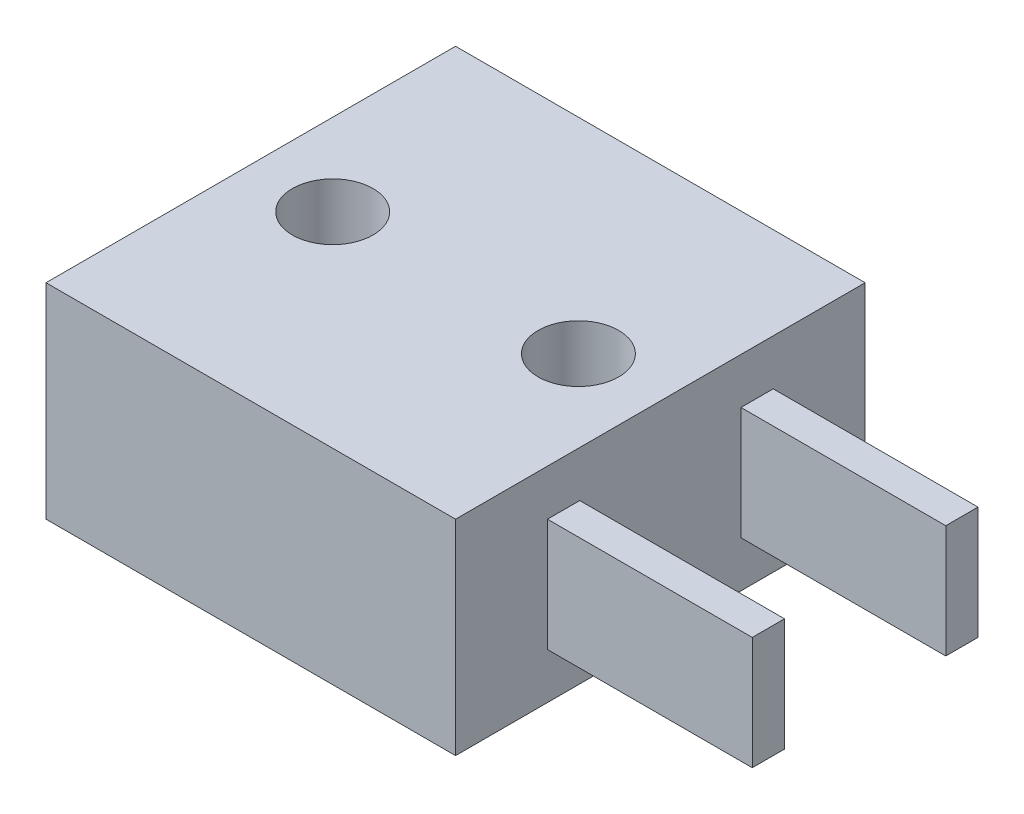
ISO-10303-21;
HEADER;
FILE_DESCRIPTION(('STEP AP214'),'2;1');
FILE_NAME('part.step','',(''),(''),'','','');
FILE_SCHEMA(('AUTOMOTIVE_DESIGN { 1 0 10303 214 1 1 1 1 }'));
ENDSEC;
DATA;
#1=APPLICATION_CONTEXT('core data for automotive mechanical design processes');
#2=APPLICATION_PROTOCOL_DEFINITION('international standard','automotive_design',2000,#1);
#3=PRODUCT_CONTEXT('',#1,'mechanical');
#4=PRODUCT('Part','Part','',(#3));
#5=PRODUCT_RELATED_PRODUCT_CATEGORY('part','',(#4));
#6=PRODUCT_DEFINITION_FORMATION('','',#4);
#7=PRODUCT_DEFINITION_CONTEXT('part definition',#1,'design');
#8=PRODUCT_DEFINITION('design','',#6,#7);
#9=PRODUCT_DEFINITION_SHAPE('','',#8);
#10=(LENGTH_UNIT() NAMED_UNIT(*) SI_UNIT(.MILLI.,.METRE.));
#11=(NAMED_UNIT(*) PLANE_ANGLE_UNIT() SI_UNIT($,.RADIAN.));
#12=(NAMED_UNIT(*) SI_UNIT($,.STERADIAN.) SOLID_ANGLE_UNIT());
#13=UNCERTAINTY_MEASURE_WITH_UNIT(LENGTH_MEASURE(1.E-05),#10,'distance_accuracy_value','');
#14=(GEOMETRIC_REPRESENTATION_CONTEXT(3) GLOBAL_UNCERTAINTY_ASSIGNED_CONTEXT((#13)) GLOBAL_UNIT_ASSIGNED_CONTEXT((#10,
#11,#12)) REPRESENTATION_CONTEXT('',''));
#15=CARTESIAN_POINT('',(0.,0.,0.));
#16=DIRECTION('',(0.,0.,1.));
#17=DIRECTION('',(1.,0.,0.));
#18=AXIS2_PLACEMENT_3D('',#15,#16,#17);
#19=CARTESIAN_POINT('',(0.,3.175,0.));
#20=DIRECTION('',(0.,1.,0.));
#21=DIRECTION('',(0.,0.,1.));
#22=AXIS2_PLACEMENT_3D('',#19,#20,#21);
#23=PLANE('',#22);
#24=CARTESIAN_POINT('',(-3.81,3.175,0.));
#25=DIRECTION('',(0.,1.,0.));
#26=DIRECTION('',(0.,0.,1.));
#27=AXIS2_PLACEMENT_3D('',#24,#25,#26);
#28=CIRCLE('',#27,1.25);
#29=CARTESIAN_POINT('',(-3.81,3.175,1.25));
#30=VERTEX_POINT('',#29);
#31=EDGE_CURVE('E227',#30,#30,#28,.T.);
#32=ORIENTED_EDGE('',*,*,#31,.F.);
#33=EDGE_LOOP('',(#32));
#34=FACE_BOUND('',#33,.T.);
#35=DIRECTION('',(0.,0.,-1.));
#36=VECTOR('',#35,1.);
#37=CARTESIAN_POINT('',(6.35,3.175,-6.35));
#38=LINE('',#37,#36);
#39=CARTESIAN_POINT('',(6.35,3.175,6.35));
#40=VERTEX_POINT('',#39);
#41=CARTESIAN_POINT('',(6.35,3.175,-6.35));
#42=VERTEX_POINT('',#41);
#43=EDGE_CURVE('E235',#40,#42,#38,.T.);
#44=ORIENTED_EDGE('',*,*,#43,.T.);
#45=DIRECTION('',(-1.,0.,0.));
#46=VECTOR('',#45,1.);
#47=CARTESIAN_POINT('',(-6.35,3.175,-6.35));
#48=LINE('',#47,#46);
#49=CARTESIAN_POINT('',(-6.35,3.175,-6.35));
#50=VERTEX_POINT('',#49);
#51=EDGE_CURVE('E239',#42,#50,#48,.T.);
#52=ORIENTED_EDGE('',*,*,#51,.T.);
#53=DIRECTION('',(0.,0.,1.));
#54=VECTOR('',#53,1.);
#55=CARTESIAN_POINT('',(-6.35,3.175,-6.35));
#56=LINE('',#55,#54);
#57=CARTESIAN_POINT('',(-6.35,3.175,6.35));
#58=VERTEX_POINT('',#57);
#59=EDGE_CURVE('E243',#50,#58,#56,.T.);
#60=ORIENTED_EDGE('',*,*,#59,.T.);
#61=DIRECTION('',(1.,0.,0.));
#62=VECTOR('',#61,1.);
#63=CARTESIAN_POINT('',(-6.35,3.175,6.35));
#64=LINE('',#63,#62);
#65=EDGE_CURVE('E246',#58,#40,#64,.T.);
#66=ORIENTED_EDGE('',*,*,#65,.T.);
#67=EDGE_LOOP('',(#44,#52,#60,#66));
#68=FACE_BOUND('',#67,.T.);
#69=CARTESIAN_POINT('',(3.81,3.175,0.));
#70=DIRECTION('',(0.,1.,0.));
#71=DIRECTION('',(0.,0.,1.));
#72=AXIS2_PLACEMENT_3D('',#69,#70,#71);
#73=CIRCLE('',#72,1.25);
#74=CARTESIAN_POINT('',(3.81,3.175,1.25));
#75=VERTEX_POINT('',#74);
#76=EDGE_CURVE('E219',#75,#75,#73,.T.);
#77=ORIENTED_EDGE('',*,*,#76,.F.);
#78=EDGE_LOOP('',(#77));
#79=FACE_BOUND('',#78,.T.);
#80=ADVANCED_FACE('F47',(#34,#68,#79),#23,.T.);
#81=CARTESIAN_POINT('',(0.,-3.175,0.));
#82=DIRECTION('',(0.,1.,0.));
#83=DIRECTION('',(0.,0.,1.));
#84=AXIS2_PLACEMENT_3D('',#81,#82,#83);
#85=PLANE('',#84);
#86=DIRECTION('',(0.,0.,-1.));
#87=VECTOR('',#86,1.);
#88=CARTESIAN_POINT('',(6.35,-3.175,-6.35));
#89=LINE('',#88,#87);
#90=CARTESIAN_POINT('',(6.35,-3.175,6.35));
#91=VERTEX_POINT('',#90);
#92=CARTESIAN_POINT('',(6.35,-3.175,-6.35));
#93=VERTEX_POINT('',#92);
#94=EDGE_CURVE('E231',#91,#93,#89,.T.);
#95=ORIENTED_EDGE('',*,*,#94,.F.);
#96=DIRECTION('',(1.,0.,0.));
#97=VECTOR('',#96,1.);
#98=CARTESIAN_POINT('',(-6.35,-3.175,6.35));
#99=LINE('',#98,#97);
#100=CARTESIAN_POINT('',(-6.35,-3.175,6.35));
#101=VERTEX_POINT('',#100);
#102=EDGE_CURVE('E240',#101,#91,#99,.T.);
#103=ORIENTED_EDGE('',*,*,#102,.F.);
#104=DIRECTION('',(0.,0.,1.));
#105=VECTOR('',#104,1.);
#106=CARTESIAN_POINT('',(-6.35,-3.175,-6.35));
#107=LINE('',#106,#105);
#108=CARTESIAN_POINT('',(-6.35,-3.175,-6.35));
#109=VERTEX_POINT('',#108);
#110=EDGE_CURVE('E256',#109,#101,#107,.T.);
#111=ORIENTED_EDGE('',*,*,#110,.F.);
#112=DIRECTION('',(-1.,0.,0.));
#113=VECTOR('',#112,1.);
#114=CARTESIAN_POINT('',(-6.35,-3.175,-6.35));
#115=LINE('',#114,#113);
#116=EDGE_CURVE('E253',#93,#109,#115,.T.);
#117=ORIENTED_EDGE('',*,*,#116,.F.);
#118=EDGE_LOOP('',(#95,#103,#111,#117));
#119=FACE_BOUND('',#118,.T.);
#120=CARTESIAN_POINT('',(-3.81,-3.175,0.));
#121=DIRECTION('',(0.,1.,0.));
#122=DIRECTION('',(0.,0.,1.));
#123=AXIS2_PLACEMENT_3D('',#120,#121,#122);
#124=CIRCLE('',#123,1.25);
#125=CARTESIAN_POINT('',(-3.81,-3.175,1.25));
#126=VERTEX_POINT('',#125);
#127=EDGE_CURVE('E223',#126,#126,#124,.T.);
#128=ORIENTED_EDGE('',*,*,#127,.T.);
#129=EDGE_LOOP('',(#128));
#130=FACE_BOUND('',#129,.T.);
#131=CARTESIAN_POINT('',(3.81,-3.175,0.));
#132=DIRECTION('',(0.,1.,0.));
#133=DIRECTION('',(0.,0.,1.));
#134=AXIS2_PLACEMENT_3D('',#131,#132,#133);
#135=CIRCLE('',#134,1.25);
#136=CARTESIAN_POINT('',(3.81,-3.175,1.25));
#137=VERTEX_POINT('',#136);
#138=EDGE_CURVE('E218',#137,#137,#135,.T.);
#139=ORIENTED_EDGE('',*,*,#138,.T.);
#140=EDGE_LOOP('',(#139));
#141=FACE_BOUND('',#140,.T.);
#142=ADVANCED_FACE('F279',(#119,#130,#141),#85,.F.);
#143=CARTESIAN_POINT('',(6.35,3.175,-6.35));
#144=DIRECTION('',(-1.,0.,0.));
#145=DIRECTION('',(0.,0.,1.));
#146=AXIS2_PLACEMENT_3D('',#143,#144,#145);
#147=PLANE('',#146);
#148=DIRECTION('',(0.,-1.,0.));
#149=VECTOR('',#148,1.);
#150=CARTESIAN_POINT('',(6.35,1.75,3.5));
#151=LINE('',#150,#149);
#152=CARTESIAN_POINT('',(6.35,1.75,3.5));
#153=VERTEX_POINT('',#152);
#154=CARTESIAN_POINT('',(6.35,-1.75,3.5));
#155=VERTEX_POINT('',#154);
#156=EDGE_CURVE('E63',#153,#155,#151,.T.);
#157=ORIENTED_EDGE('',*,*,#156,.F.);
#158=DIRECTION('',(0.,0.,1.));
#159=VECTOR('',#158,1.);
#160=CARTESIAN_POINT('',(6.35,1.75,3.5));
#161=LINE('',#160,#159);
#162=CARTESIAN_POINT('',(6.35,1.75,2.5));
#163=VERTEX_POINT('',#162);
#164=EDGE_CURVE('E67',#163,#153,#161,.T.);
#165=ORIENTED_EDGE('',*,*,#164,.F.);
#166=DIRECTION('',(0.,-1.,0.));
#167=VECTOR('',#166,1.);
#168=CARTESIAN_POINT('',(6.35,1.75,2.5));
#169=LINE('',#168,#167);
#170=CARTESIAN_POINT('',(6.35,-1.75,2.5));
#171=VERTEX_POINT('',#170);
#172=EDGE_CURVE('E133',#163,#171,#169,.T.);
#173=ORIENTED_EDGE('',*,*,#172,.T.);
#174=DIRECTION('',(0.,0.,1.));
#175=VECTOR('',#174,1.);
#176=CARTESIAN_POINT('',(6.35,-1.75,3.5));
#177=LINE('',#176,#175);
#178=EDGE_CURVE('E137',#171,#155,#177,.T.);
#179=ORIENTED_EDGE('',*,*,#178,.T.);
#180=EDGE_LOOP('',(#157,#165,#173,#179));
#181=FACE_BOUND('',#180,.T.);
#182=DIRECTION('',(0.,-1.,0.));
#183=VECTOR('',#182,1.);
#184=CARTESIAN_POINT('',(6.35,1.75,-2.5));
#185=LINE('',#184,#183);
#186=CARTESIAN_POINT('',(6.35,1.75,-2.5));
#187=VERTEX_POINT('',#186);
#188=CARTESIAN_POINT('',(6.35,-1.75,-2.5));
#189=VERTEX_POINT('',#188);
#190=EDGE_CURVE('E214',#187,#189,#185,.T.);
#191=ORIENTED_EDGE('',*,*,#190,.F.);
#192=DIRECTION('',(0.,0.,1.));
#193=VECTOR('',#192,1.);
#194=CARTESIAN_POINT('',(6.35,1.75,-3.5));
#195=LINE('',#194,#193);
#196=CARTESIAN_POINT('',(6.35,1.75,-3.5));
#197=VERTEX_POINT('',#196);
#198=EDGE_CURVE('E177',#197,#187,#195,.T.);
#199=ORIENTED_EDGE('',*,*,#198,.F.);
#200=DIRECTION('',(0.,-1.,0.));
#201=VECTOR('',#200,1.);
#202=CARTESIAN_POINT('',(6.35,1.75,-3.5));
#203=LINE('',#202,#201);
#204=CARTESIAN_POINT('',(6.35,-1.75,-3.5));
#205=VERTEX_POINT('',#204);
#206=EDGE_CURVE('E192',#197,#205,#203,.T.);
#207=ORIENTED_EDGE('',*,*,#206,.T.);
#208=DIRECTION('',(0.,0.,1.));
#209=VECTOR('',#208,1.);
#210=CARTESIAN_POINT('',(6.35,-1.75,-3.5));
#211=LINE('',#210,#209);
#212=EDGE_CURVE('E169',#205,#189,#211,.T.);
#213=ORIENTED_EDGE('',*,*,#212,.T.);
#214=EDGE_LOOP('',(#191,#199,#207,#213));
#215=FACE_BOUND('',#214,.T.);
#216=ORIENTED_EDGE('',*,*,#94,.T.);
#217=DIRECTION('',(0.,-1.,0.));
#218=VECTOR('',#217,1.);
#219=CARTESIAN_POINT('',(6.35,3.175,-6.35));
#220=LINE('',#219,#218);
#221=EDGE_CURVE('E11',#42,#93,#220,.T.);
#222=ORIENTED_EDGE('',*,*,#221,.F.);
#223=ORIENTED_EDGE('',*,*,#43,.F.);
#224=DIRECTION('',(0.,-1.,0.));
#225=VECTOR('',#224,1.);
#226=CARTESIAN_POINT('',(6.35,3.175,6.35));
#227=LINE('',#226,#225);
#228=EDGE_CURVE('E249',#40,#91,#227,.T.);
#229=ORIENTED_EDGE('',*,*,#228,.T.);
#230=EDGE_LOOP('',(#216,#222,#223,#229));
#231=FACE_BOUND('',#230,.T.);
#232=ADVANCED_FACE('F49',(#181,#215,#231),#147,.F.);
#233=CARTESIAN_POINT('',(-6.35,3.175,-6.35));
#234=DIRECTION('',(0.,0.,1.));
#235=DIRECTION('',(1.,0.,0.));
#236=AXIS2_PLACEMENT_3D('',#233,#234,#235);
#237=PLANE('',#236);
#238=ORIENTED_EDGE('',*,*,#116,.T.);
#239=DIRECTION('',(0.,-1.,0.));
#240=VECTOR('',#239,1.);
#241=CARTESIAN_POINT('',(-6.35,3.175,-6.35));
#242=LINE('',#241,#240);
#243=EDGE_CURVE('E56',#50,#109,#242,.T.);
#244=ORIENTED_EDGE('',*,*,#243,.F.);
#245=ORIENTED_EDGE('',*,*,#51,.F.);
#246=ORIENTED_EDGE('',*,*,#221,.T.);
#247=EDGE_LOOP('',(#238,#244,#245,#246));
#248=FACE_BOUND('',#247,.T.);
#249=ADVANCED_FACE('F290',(#248),#237,.F.);
#250=CARTESIAN_POINT('',(-6.35,3.175,-6.35));
#251=DIRECTION('',(1.,0.,0.));
#252=DIRECTION('',(0.,0.,-1.));
#253=AXIS2_PLACEMENT_3D('',#250,#251,#252);
#254=PLANE('',#253);
#255=ORIENTED_EDGE('',*,*,#110,.T.);
#256=DIRECTION('',(0.,-1.,0.));
#257=VECTOR('',#256,1.);
#258=CARTESIAN_POINT('',(-6.35,3.175,6.35));
#259=LINE('',#258,#257);
#260=EDGE_CURVE('E264',#58,#101,#259,.T.);
#261=ORIENTED_EDGE('',*,*,#260,.F.);
#262=ORIENTED_EDGE('',*,*,#59,.F.);
#263=ORIENTED_EDGE('',*,*,#243,.T.);
#264=EDGE_LOOP('',(#255,#261,#262,#263));
#265=FACE_BOUND('',#264,.T.);
#266=ADVANCED_FACE('F273',(#265),#254,.F.);
#267=CARTESIAN_POINT('',(-6.35,3.175,6.35));
#268=DIRECTION('',(0.,0.,-1.));
#269=DIRECTION('',(-1.,0.,0.));
#270=AXIS2_PLACEMENT_3D('',#267,#268,#269);
#271=PLANE('',#270);
#272=ORIENTED_EDGE('',*,*,#102,.T.);
#273=ORIENTED_EDGE('',*,*,#228,.F.);
#274=ORIENTED_EDGE('',*,*,#65,.F.);
#275=ORIENTED_EDGE('',*,*,#260,.T.);
#276=EDGE_LOOP('',(#272,#273,#274,#275));
#277=FACE_BOUND('',#276,.T.);
#278=ADVANCED_FACE('F283',(#277),#271,.F.);
#279=CARTESIAN_POINT('',(-3.81,3.175,0.));
#280=DIRECTION('',(0.,-1.,0.));
#281=DIRECTION('',(0.,0.,-1.));
#282=AXIS2_PLACEMENT_3D('',#279,#280,#281);
#283=CYLINDRICAL_SURFACE('',#282,1.25);
#284=ORIENTED_EDGE('',*,*,#31,.T.);
#285=EDGE_LOOP('',(#284));
#286=FACE_BOUND('',#285,.T.);
#287=ORIENTED_EDGE('',*,*,#127,.F.);
#288=EDGE_LOOP('',(#287));
#289=FACE_BOUND('',#288,.T.);
#290=ADVANCED_FACE('F306',(#286,#289),#283,.F.);
#291=CARTESIAN_POINT('',(3.81,3.175,0.));
#292=DIRECTION('',(0.,-1.,0.));
#293=DIRECTION('',(0.,0.,-1.));
#294=AXIS2_PLACEMENT_3D('',#291,#292,#293);
#295=CYLINDRICAL_SURFACE('',#294,1.25);
#296=ORIENTED_EDGE('',*,*,#76,.T.);
#297=EDGE_LOOP('',(#296));
#298=FACE_BOUND('',#297,.T.);
#299=ORIENTED_EDGE('',*,*,#138,.F.);
#300=EDGE_LOOP('',(#299));
#301=FACE_BOUND('',#300,.T.);
#302=ADVANCED_FACE('F313',(#298,#301),#295,.F.);
#303=CARTESIAN_POINT('',(6.35,1.75,-2.5));
#304=DIRECTION('',(0.,0.,-1.));
#305=DIRECTION('',(-1.,0.,0.));
#306=AXIS2_PLACEMENT_3D('',#303,#304,#305);
#307=PLANE('',#306);
#308=DIRECTION('',(1.,0.,0.));
#309=VECTOR('',#308,1.);
#310=CARTESIAN_POINT('',(6.35,-1.75,-2.5));
#311=LINE('',#310,#309);
#312=CARTESIAN_POINT('',(12.7,-1.75,-2.5));
#313=VERTEX_POINT('',#312);
#314=EDGE_CURVE('E195',#189,#313,#311,.T.);
#315=ORIENTED_EDGE('',*,*,#314,.T.);
#316=DIRECTION('',(0.,-1.,0.));
#317=VECTOR('',#316,1.);
#318=CARTESIAN_POINT('',(12.7,1.75,-2.5));
#319=LINE('',#318,#317);
#320=CARTESIAN_POINT('',(12.7,1.75,-2.5));
#321=VERTEX_POINT('',#320);
#322=EDGE_CURVE('E210',#321,#313,#319,.T.);
#323=ORIENTED_EDGE('',*,*,#322,.F.);
#324=DIRECTION('',(1.,0.,0.));
#325=VECTOR('',#324,1.);
#326=CARTESIAN_POINT('',(6.35,1.75,-2.5));
#327=LINE('',#326,#325);
#328=EDGE_CURVE('E181',#187,#321,#327,.T.);
#329=ORIENTED_EDGE('',*,*,#328,.F.);
#330=ORIENTED_EDGE('',*,*,#190,.T.);
#331=EDGE_LOOP('',(#315,#323,#329,#330));
#332=FACE_BOUND('',#331,.T.);
#333=ADVANCED_FACE('F318',(#332),#307,.F.);
#334=CARTESIAN_POINT('',(12.7,1.75,-3.5));
#335=DIRECTION('',(-1.,0.,0.));
#336=DIRECTION('',(0.,0.,1.));
#337=AXIS2_PLACEMENT_3D('',#334,#335,#336);
#338=PLANE('',#337);
#339=DIRECTION('',(0.,0.,-1.));
#340=VECTOR('',#339,1.);
#341=CARTESIAN_POINT('',(12.7,-1.75,-3.5));
#342=LINE('',#341,#340);
#343=CARTESIAN_POINT('',(12.7,-1.75,-3.5));
#344=VERTEX_POINT('',#343);
#345=EDGE_CURVE('E198',#313,#344,#342,.T.);
#346=ORIENTED_EDGE('',*,*,#345,.T.);
#347=DIRECTION('',(0.,-1.,0.));
#348=VECTOR('',#347,1.);
#349=CARTESIAN_POINT('',(12.7,1.75,-3.5));
#350=LINE('',#349,#348);
#351=CARTESIAN_POINT('',(12.7,1.75,-3.5));
#352=VERTEX_POINT('',#351);
#353=EDGE_CURVE('E206',#352,#344,#350,.T.);
#354=ORIENTED_EDGE('',*,*,#353,.F.);
#355=DIRECTION('',(0.,0.,-1.));
#356=VECTOR('',#355,1.);
#357=CARTESIAN_POINT('',(12.7,1.75,-3.5));
#358=LINE('',#357,#356);
#359=EDGE_CURVE('E185',#321,#352,#358,.T.);
#360=ORIENTED_EDGE('',*,*,#359,.F.);
#361=ORIENTED_EDGE('',*,*,#322,.T.);
#362=EDGE_LOOP('',(#346,#354,#360,#361));
#363=FACE_BOUND('',#362,.T.);
#364=ADVANCED_FACE('F328',(#363),#338,.F.);
#365=CARTESIAN_POINT('',(6.35,1.75,-3.5));
#366=DIRECTION('',(0.,0.,1.));
#367=DIRECTION('',(1.,0.,0.));
#368=AXIS2_PLACEMENT_3D('',#365,#366,#367);
#369=PLANE('',#368);
#370=DIRECTION('',(-1.,0.,0.));
#371=VECTOR('',#370,1.);
#372=CARTESIAN_POINT('',(6.35,-1.75,-3.5));
#373=LINE('',#372,#371);
#374=EDGE_CURVE('E182',#344,#205,#373,.T.);
#375=ORIENTED_EDGE('',*,*,#374,.T.);
#376=ORIENTED_EDGE('',*,*,#206,.F.);
#377=DIRECTION('',(-1.,0.,0.));
#378=VECTOR('',#377,1.);
#379=CARTESIAN_POINT('',(6.35,1.75,-3.5));
#380=LINE('',#379,#378);
#381=EDGE_CURVE('E188',#352,#197,#380,.T.);
#382=ORIENTED_EDGE('',*,*,#381,.F.);
#383=ORIENTED_EDGE('',*,*,#353,.T.);
#384=EDGE_LOOP('',(#375,#376,#382,#383));
#385=FACE_BOUND('',#384,.T.);
#386=ADVANCED_FACE('F334',(#385),#369,.F.);
#387=CARTESIAN_POINT('',(0.,1.75,0.));
#388=DIRECTION('',(0.,1.,0.));
#389=DIRECTION('',(0.,0.,1.));
#390=AXIS2_PLACEMENT_3D('',#387,#388,#389);
#391=PLANE('',#390);
#392=ORIENTED_EDGE('',*,*,#198,.T.);
#393=ORIENTED_EDGE('',*,*,#328,.T.);
#394=ORIENTED_EDGE('',*,*,#359,.T.);
#395=ORIENTED_EDGE('',*,*,#381,.T.);
#396=EDGE_LOOP('',(#392,#393,#394,#395));
#397=FACE_BOUND('',#396,.T.);
#398=ADVANCED_FACE('F338',(#397),#391,.T.);
#399=CARTESIAN_POINT('',(0.,-1.75,0.));
#400=DIRECTION('',(0.,1.,0.));
#401=DIRECTION('',(0.,0.,1.));
#402=AXIS2_PLACEMENT_3D('',#399,#400,#401);
#403=PLANE('',#402);
#404=ORIENTED_EDGE('',*,*,#212,.F.);
#405=ORIENTED_EDGE('',*,*,#374,.F.);
#406=ORIENTED_EDGE('',*,*,#345,.F.);
#407=ORIENTED_EDGE('',*,*,#314,.F.);
#408=EDGE_LOOP('',(#404,#405,#406,#407));
#409=FACE_BOUND('',#408,.T.);
#410=ADVANCED_FACE('F340',(#409),#403,.F.);
#411=CARTESIAN_POINT('',(6.35,1.75,3.5));
#412=DIRECTION('',(0.,0.,-1.));
#413=DIRECTION('',(-1.,0.,0.));
#414=AXIS2_PLACEMENT_3D('',#411,#412,#413);
#415=PLANE('',#414);
#416=DIRECTION('',(1.,0.,0.));
#417=VECTOR('',#416,1.);
#418=CARTESIAN_POINT('',(6.35,-1.75,3.5));
#419=LINE('',#418,#417);
#420=CARTESIAN_POINT('',(12.7,-1.75,3.5));
#421=VERTEX_POINT('',#420);
#422=EDGE_CURVE('E155',#155,#421,#419,.T.);
#423=ORIENTED_EDGE('',*,*,#422,.T.);
#424=DIRECTION('',(0.,-1.,0.));
#425=VECTOR('',#424,1.);
#426=CARTESIAN_POINT('',(12.7,1.75,3.5));
#427=LINE('',#426,#425);
#428=CARTESIAN_POINT('',(12.7,1.75,3.5));
#429=VERTEX_POINT('',#428);
#430=EDGE_CURVE('E367',#429,#421,#427,.T.);
#431=ORIENTED_EDGE('',*,*,#430,.F.);
#432=DIRECTION('',(1.,0.,0.));
#433=VECTOR('',#432,1.);
#434=CARTESIAN_POINT('',(6.35,1.75,3.5));
#435=LINE('',#434,#433);
#436=EDGE_CURVE('E157',#153,#429,#435,.T.);
#437=ORIENTED_EDGE('',*,*,#436,.F.);
#438=ORIENTED_EDGE('',*,*,#156,.T.);
#439=EDGE_LOOP('',(#423,#431,#437,#438));
#440=FACE_BOUND('',#439,.T.);
#441=ADVANCED_FACE('F343',(#440),#415,.F.);
#442=CARTESIAN_POINT('',(12.7,1.75,3.5));
#443=DIRECTION('',(-1.,0.,0.));
#444=DIRECTION('',(0.,0.,1.));
#445=AXIS2_PLACEMENT_3D('',#442,#443,#444);
#446=PLANE('',#445);
#447=DIRECTION('',(0.,0.,-1.));
#448=VECTOR('',#447,1.);
#449=CARTESIAN_POINT('',(12.7,-1.75,3.5));
#450=LINE('',#449,#448);
#451=CARTESIAN_POINT('',(12.7,-1.75,2.5));
#452=VERTEX_POINT('',#451);
#453=EDGE_CURVE('E150',#421,#452,#450,.T.);
#454=ORIENTED_EDGE('',*,*,#453,.T.);
#455=DIRECTION('',(0.,-1.,0.));
#456=VECTOR('',#455,1.);
#457=CARTESIAN_POINT('',(12.7,1.75,2.5));
#458=LINE('',#457,#456);
#459=CARTESIAN_POINT('',(12.7,1.75,2.5));
#460=VERTEX_POINT('',#459);
#461=EDGE_CURVE('E141',#460,#452,#458,.T.);
#462=ORIENTED_EDGE('',*,*,#461,.F.);
#463=DIRECTION('',(0.,0.,-1.));
#464=VECTOR('',#463,1.);
#465=CARTESIAN_POINT('',(12.7,1.75,3.5));
#466=LINE('',#465,#464);
#467=EDGE_CURVE('E161',#429,#460,#466,.T.);
#468=ORIENTED_EDGE('',*,*,#467,.F.);
#469=ORIENTED_EDGE('',*,*,#430,.T.);
#470=EDGE_LOOP('',(#454,#462,#468,#469));
#471=FACE_BOUND('',#470,.T.);
#472=ADVANCED_FACE('F356',(#471),#446,.F.);
#473=CARTESIAN_POINT('',(6.35,1.75,2.5));
#474=DIRECTION('',(0.,0.,1.));
#475=DIRECTION('',(1.,0.,0.));
#476=AXIS2_PLACEMENT_3D('',#473,#474,#475);
#477=PLANE('',#476);
#478=DIRECTION('',(-1.,0.,0.));
#479=VECTOR('',#478,1.);
#480=CARTESIAN_POINT('',(6.35,-1.75,2.5));
#481=LINE('',#480,#479);
#482=EDGE_CURVE('E145',#452,#171,#481,.T.);
#483=ORIENTED_EDGE('',*,*,#482,.T.);
#484=ORIENTED_EDGE('',*,*,#172,.F.);
#485=DIRECTION('',(-1.,0.,0.));
#486=VECTOR('',#485,1.);
#487=CARTESIAN_POINT('',(6.35,1.75,2.5));
#488=LINE('',#487,#486);
#489=EDGE_CURVE('E172',#460,#163,#488,.T.);
#490=ORIENTED_EDGE('',*,*,#489,.F.);
#491=ORIENTED_EDGE('',*,*,#461,.T.);
#492=EDGE_LOOP('',(#483,#484,#490,#491));
#493=FACE_BOUND('',#492,.T.);
#494=ADVANCED_FACE('F146',(#493),#477,.F.);
#495=CARTESIAN_POINT('',(0.,1.75,0.));
#496=DIRECTION('',(0.,1.,0.));
#497=DIRECTION('',(0.,0.,1.));
#498=AXIS2_PLACEMENT_3D('',#495,#496,#497);
#499=PLANE('',#498);
#500=ORIENTED_EDGE('',*,*,#436,.T.);
#501=ORIENTED_EDGE('',*,*,#467,.T.);
#502=ORIENTED_EDGE('',*,*,#489,.T.);
#503=ORIENTED_EDGE('',*,*,#164,.T.);
#504=EDGE_LOOP('',(#500,#501,#502,#503));
#505=FACE_BOUND('',#504,.T.);
#506=ADVANCED_FACE('F348',(#505),#499,.T.);
#507=CARTESIAN_POINT('',(0.,-1.75,0.));
#508=DIRECTION('',(0.,1.,0.));
#509=DIRECTION('',(0.,0.,1.));
#510=AXIS2_PLACEMENT_3D('',#507,#508,#509);
#511=PLANE('',#510);
#512=ORIENTED_EDGE('',*,*,#422,.F.);
#513=ORIENTED_EDGE('',*,*,#178,.F.);
#514=ORIENTED_EDGE('',*,*,#482,.F.);
#515=ORIENTED_EDGE('',*,*,#453,.F.);
#516=EDGE_LOOP('',(#512,#513,#514,#515));
#517=FACE_BOUND('',#516,.T.);
#518=ADVANCED_FACE('F153',(#517),#511,.F.);
#519=CLOSED_SHELL('',(#80,#142,#232,#249,#266,#278,#290,#302,#333,#364,#386,#398,#410,#441,#472,
#494,#506,#518));
#520=MANIFOLD_SOLID_BREP('B2',#519);
#521=ADVANCED_BREP_SHAPE_REPRESENTATION('',(#18,#520),#14);
#522=SHAPE_DEFINITION_REPRESENTATION(#9,#521);
ENDSEC;
END-ISO-10303-21;
